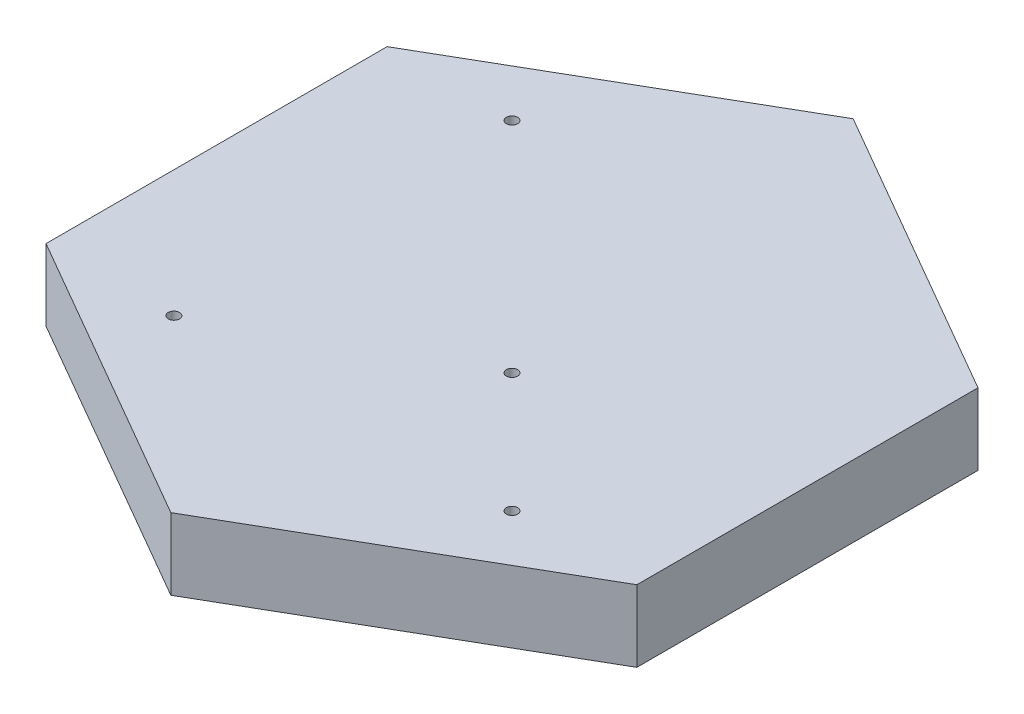
ISO-10303-21;
HEADER;
FILE_DESCRIPTION(('STEP AP214'),'2;1');
FILE_NAME('part.step','',(''),(''),'','','');
FILE_SCHEMA(('AUTOMOTIVE_DESIGN { 1 0 10303 214 1 1 1 1 }'));
ENDSEC;
DATA;
#1=APPLICATION_CONTEXT('core data for automotive mechanical design processes');
#2=APPLICATION_PROTOCOL_DEFINITION('international standard','automotive_design',2000,#1);
#3=PRODUCT_CONTEXT('',#1,'mechanical');
#4=PRODUCT('Part','Part','',(#3));
#5=PRODUCT_RELATED_PRODUCT_CATEGORY('part','',(#4));
#6=PRODUCT_DEFINITION_FORMATION('','',#4);
#7=PRODUCT_DEFINITION_CONTEXT('part definition',#1,'design');
#8=PRODUCT_DEFINITION('design','',#6,#7);
#9=PRODUCT_DEFINITION_SHAPE('','',#8);
#10=(LENGTH_UNIT() NAMED_UNIT(*) SI_UNIT(.MILLI.,.METRE.));
#11=(NAMED_UNIT(*) PLANE_ANGLE_UNIT() SI_UNIT($,.RADIAN.));
#12=(NAMED_UNIT(*) SI_UNIT($,.STERADIAN.) SOLID_ANGLE_UNIT());
#13=UNCERTAINTY_MEASURE_WITH_UNIT(LENGTH_MEASURE(1.E-05),#10,'distance_accuracy_value','');
#14=(GEOMETRIC_REPRESENTATION_CONTEXT(3) GLOBAL_UNCERTAINTY_ASSIGNED_CONTEXT((#13)) GLOBAL_UNIT_ASSIGNED_CONTEXT((#10,
#11,#12)) REPRESENTATION_CONTEXT('',''));
#15=CARTESIAN_POINT('',(0.,0.,0.));
#16=DIRECTION('',(0.,0.,1.));
#17=DIRECTION('',(1.,0.,0.));
#18=AXIS2_PLACEMENT_3D('',#15,#16,#17);
#19=CARTESIAN_POINT('',(8.78679656440357,172.865318601196,8.78679656440358));
#20=DIRECTION('',(0.,-1.,0.));
#21=DIRECTION('',(0.,0.,-1.));
#22=AXIS2_PLACEMENT_3D('',#19,#20,#21);
#23=CYLINDRICAL_SURFACE('',#22,1.);
#24=CARTESIAN_POINT('',(8.78679656440357,0.,8.78679656440358));
#25=DIRECTION('',(0.,1.,0.));
#26=DIRECTION('',(0.,0.,1.));
#27=AXIS2_PLACEMENT_3D('',#24,#25,#26);
#28=CIRCLE('',#27,1.);
#29=CARTESIAN_POINT('',(8.78679656440357,0.,9.78679656440358));
#30=VERTEX_POINT('',#29);
#31=EDGE_CURVE('E125',#30,#30,#28,.T.);
#32=ORIENTED_EDGE('',*,*,#31,.F.);
#33=EDGE_LOOP('',(#32));
#34=FACE_BOUND('',#33,.T.);
#35=CARTESIAN_POINT('',(8.78679656440357,12.7,8.78679656440358));
#36=DIRECTION('',(0.,1.,0.));
#37=DIRECTION('',(0.,0.,1.));
#38=AXIS2_PLACEMENT_3D('',#35,#36,#37);
#39=CIRCLE('',#38,1.);
#40=CARTESIAN_POINT('',(8.78679656440357,12.7,9.78679656440358));
#41=VERTEX_POINT('',#40);
#42=EDGE_CURVE('E111',#41,#41,#39,.T.);
#43=ORIENTED_EDGE('',*,*,#42,.T.);
#44=EDGE_LOOP('',(#43));
#45=FACE_BOUND('',#44,.T.);
#46=ADVANCED_FACE('F33',(#34,#45),#23,.F.);
#47=CARTESIAN_POINT('',(0.,172.865318601196,60.5368002394561));
#48=DIRECTION('',(-0.5,0.,-0.866025403784438));
#49=DIRECTION('',(-0.866025403784439,0.,0.5));
#50=AXIS2_PLACEMENT_3D('',#47,#48,#49);
#51=PLANE('',#50);
#52=DIRECTION('',(0.866025403784439,0.,-0.5));
#53=VECTOR('',#52,1.);
#54=CARTESIAN_POINT('',(0.,12.7,60.5368002394561));
#55=LINE('',#54,#53);
#56=CARTESIAN_POINT('',(0.,12.7,60.5368002394561));
#57=VERTEX_POINT('',#56);
#58=CARTESIAN_POINT('',(52.4264068711929,12.7,30.2684001197281));
#59=VERTEX_POINT('',#58);
#60=EDGE_CURVE('E90',#57,#59,#55,.T.);
#61=ORIENTED_EDGE('',*,*,#60,.F.);
#62=DIRECTION('',(0.,-1.,0.));
#63=VECTOR('',#62,1.);
#64=CARTESIAN_POINT('',(0.,172.865318601196,60.5368002394561));
#65=LINE('',#64,#63);
#66=CARTESIAN_POINT('',(0.,0.,60.5368002394561));
#67=VERTEX_POINT('',#66);
#68=EDGE_CURVE('E49',#57,#67,#65,.T.);
#69=ORIENTED_EDGE('',*,*,#68,.T.);
#70=DIRECTION('',(0.866025403784438,0.,-0.5));
#71=VECTOR('',#70,1.);
#72=CARTESIAN_POINT('',(0.,0.,60.5368002394561));
#73=LINE('',#72,#71);
#74=CARTESIAN_POINT('',(52.4264068711929,0.,30.2684001197281));
#75=VERTEX_POINT('',#74);
#76=EDGE_CURVE('E93',#67,#75,#73,.T.);
#77=ORIENTED_EDGE('',*,*,#76,.T.);
#78=DIRECTION('',(0.,-1.,0.));
#79=VECTOR('',#78,1.);
#80=CARTESIAN_POINT('',(52.4264068711929,172.865318601196,30.2684001197281));
#81=LINE('',#80,#79);
#82=EDGE_CURVE('E86',#59,#75,#81,.T.);
#83=ORIENTED_EDGE('',*,*,#82,.F.);
#84=EDGE_LOOP('',(#61,#69,#77,#83));
#85=FACE_BOUND('',#84,.T.);
#86=ADVANCED_FACE('F88',(#85),#51,.F.);
#87=CARTESIAN_POINT('',(-52.4264068711928,172.865318601196,30.2684001197281));
#88=DIRECTION('',(0.5,0.,-0.866025403784439));
#89=DIRECTION('',(-0.866025403784439,0.,-0.5));
#90=AXIS2_PLACEMENT_3D('',#87,#88,#89);
#91=PLANE('',#90);
#92=DIRECTION('',(0.866025403784439,0.,0.5));
#93=VECTOR('',#92,1.);
#94=CARTESIAN_POINT('',(-52.4264068711928,12.7,30.2684001197281));
#95=LINE('',#94,#93);
#96=CARTESIAN_POINT('',(-52.4264068711928,12.7,30.2684001197281));
#97=VERTEX_POINT('',#96);
#98=EDGE_CURVE('E105',#97,#57,#95,.T.);
#99=ORIENTED_EDGE('',*,*,#98,.F.);
#100=DIRECTION('',(0.,-1.,0.));
#101=VECTOR('',#100,1.);
#102=CARTESIAN_POINT('',(-52.4264068711928,172.865318601196,30.2684001197281));
#103=LINE('',#102,#101);
#104=CARTESIAN_POINT('',(-52.4264068711928,0.,30.2684001197281));
#105=VERTEX_POINT('',#104);
#106=EDGE_CURVE('E146',#97,#105,#103,.T.);
#107=ORIENTED_EDGE('',*,*,#106,.T.);
#108=DIRECTION('',(0.866025403784439,0.,0.5));
#109=VECTOR('',#108,1.);
#110=CARTESIAN_POINT('',(-52.4264068711928,0.,30.2684001197281));
#111=LINE('',#110,#109);
#112=EDGE_CURVE('E142',#105,#67,#111,.T.);
#113=ORIENTED_EDGE('',*,*,#112,.T.);
#114=ORIENTED_EDGE('',*,*,#68,.F.);
#115=EDGE_LOOP('',(#99,#107,#113,#114));
#116=FACE_BOUND('',#115,.T.);
#117=ADVANCED_FACE('F164',(#116),#91,.F.);
#118=CARTESIAN_POINT('',(-52.4264068711928,172.865318601196,-30.2684001197281));
#119=DIRECTION('',(1.,0.,0.));
#120=DIRECTION('',(0.,0.,-1.));
#121=AXIS2_PLACEMENT_3D('',#118,#119,#120);
#122=PLANE('',#121);
#123=DIRECTION('',(0.,0.,1.));
#124=VECTOR('',#123,1.);
#125=CARTESIAN_POINT('',(-52.4264068711928,12.7,-30.2684001197281));
#126=LINE('',#125,#124);
#127=CARTESIAN_POINT('',(-52.4264068711928,12.7,-30.2684001197281));
#128=VERTEX_POINT('',#127);
#129=EDGE_CURVE('E108',#128,#97,#126,.T.);
#130=ORIENTED_EDGE('',*,*,#129,.F.);
#131=DIRECTION('',(0.,-1.,0.));
#132=VECTOR('',#131,1.);
#133=CARTESIAN_POINT('',(-52.4264068711928,172.865318601196,-30.2684001197281));
#134=LINE('',#133,#132);
#135=CARTESIAN_POINT('',(-52.4264068711928,0.,-30.2684001197281));
#136=VERTEX_POINT('',#135);
#137=EDGE_CURVE('E148',#128,#136,#134,.T.);
#138=ORIENTED_EDGE('',*,*,#137,.T.);
#139=DIRECTION('',(0.,0.,1.));
#140=VECTOR('',#139,1.);
#141=CARTESIAN_POINT('',(-52.4264068711928,0.,-30.2684001197281));
#142=LINE('',#141,#140);
#143=EDGE_CURVE('E139',#136,#105,#142,.T.);
#144=ORIENTED_EDGE('',*,*,#143,.T.);
#145=ORIENTED_EDGE('',*,*,#106,.F.);
#146=EDGE_LOOP('',(#130,#138,#144,#145));
#147=FACE_BOUND('',#146,.T.);
#148=ADVANCED_FACE('F163',(#147),#122,.F.);
#149=CARTESIAN_POINT('',(0.,172.865318601196,-60.5368002394561));
#150=DIRECTION('',(0.5,0.,0.866025403784439));
#151=DIRECTION('',(0.866025403784439,0.,-0.5));
#152=AXIS2_PLACEMENT_3D('',#149,#150,#151);
#153=PLANE('',#152);
#154=DIRECTION('',(-0.866025403784439,0.,0.5));
#155=VECTOR('',#154,1.);
#156=CARTESIAN_POINT('',(0.,12.7,-60.5368002394561));
#157=LINE('',#156,#155);
#158=CARTESIAN_POINT('',(0.,12.7,-60.5368002394561));
#159=VERTEX_POINT('',#158);
#160=EDGE_CURVE('E116',#159,#128,#157,.T.);
#161=ORIENTED_EDGE('',*,*,#160,.F.);
#162=DIRECTION('',(0.,-1.,0.));
#163=VECTOR('',#162,1.);
#164=CARTESIAN_POINT('',(0.,172.865318601196,-60.5368002394561));
#165=LINE('',#164,#163);
#166=CARTESIAN_POINT('',(0.,0.,-60.5368002394561));
#167=VERTEX_POINT('',#166);
#168=EDGE_CURVE('E42',#159,#167,#165,.T.);
#169=ORIENTED_EDGE('',*,*,#168,.T.);
#170=DIRECTION('',(-0.866025403784439,0.,0.5));
#171=VECTOR('',#170,1.);
#172=CARTESIAN_POINT('',(0.,0.,-60.5368002394561));
#173=LINE('',#172,#171);
#174=EDGE_CURVE('E136',#167,#136,#173,.T.);
#175=ORIENTED_EDGE('',*,*,#174,.T.);
#176=ORIENTED_EDGE('',*,*,#137,.F.);
#177=EDGE_LOOP('',(#161,#169,#175,#176));
#178=FACE_BOUND('',#177,.T.);
#179=ADVANCED_FACE('F151',(#178),#153,.F.);
#180=CARTESIAN_POINT('',(52.4264068711929,172.865318601196,-30.2684001197281));
#181=DIRECTION('',(-0.5,0.,0.866025403784439));
#182=DIRECTION('',(0.866025403784439,0.,0.5));
#183=AXIS2_PLACEMENT_3D('',#180,#181,#182);
#184=PLANE('',#183);
#185=DIRECTION('',(-0.866025403784439,0.,-0.5));
#186=VECTOR('',#185,1.);
#187=CARTESIAN_POINT('',(52.4264068711929,12.7,-30.2684001197281));
#188=LINE('',#187,#186);
#189=CARTESIAN_POINT('',(52.4264068711929,12.7,-30.2684001197281));
#190=VERTEX_POINT('',#189);
#191=EDGE_CURVE('E56',#190,#159,#188,.T.);
#192=ORIENTED_EDGE('',*,*,#191,.F.);
#193=DIRECTION('',(0.,-1.,0.));
#194=VECTOR('',#193,1.);
#195=CARTESIAN_POINT('',(52.4264068711929,172.865318601196,-30.2684001197281));
#196=LINE('',#195,#194);
#197=CARTESIAN_POINT('',(52.4264068711929,0.,-30.2684001197281));
#198=VERTEX_POINT('',#197);
#199=EDGE_CURVE('E11',#190,#198,#196,.T.);
#200=ORIENTED_EDGE('',*,*,#199,.T.);
#201=DIRECTION('',(-0.866025403784439,0.,-0.5));
#202=VECTOR('',#201,1.);
#203=CARTESIAN_POINT('',(52.4264068711929,0.,-30.2684001197281));
#204=LINE('',#203,#202);
#205=EDGE_CURVE('E133',#198,#167,#204,.T.);
#206=ORIENTED_EDGE('',*,*,#205,.T.);
#207=ORIENTED_EDGE('',*,*,#168,.F.);
#208=EDGE_LOOP('',(#192,#200,#206,#207));
#209=FACE_BOUND('',#208,.T.);
#210=ADVANCED_FACE('F156',(#209),#184,.F.);
#211=CARTESIAN_POINT('',(52.4264068711929,172.865318601196,30.2684001197281));
#212=DIRECTION('',(-1.,0.,0.));
#213=DIRECTION('',(0.,0.,1.));
#214=AXIS2_PLACEMENT_3D('',#211,#212,#213);
#215=PLANE('',#214);
#216=DIRECTION('',(0.,0.,-1.));
#217=VECTOR('',#216,1.);
#218=CARTESIAN_POINT('',(52.4264068711929,12.7,30.2684001197281));
#219=LINE('',#218,#217);
#220=EDGE_CURVE('E99',#59,#190,#219,.T.);
#221=ORIENTED_EDGE('',*,*,#220,.F.);
#222=ORIENTED_EDGE('',*,*,#82,.T.);
#223=DIRECTION('',(0.,0.,-1.));
#224=VECTOR('',#223,1.);
#225=CARTESIAN_POINT('',(52.4264068711929,0.,30.2684001197281));
#226=LINE('',#225,#224);
#227=EDGE_CURVE('E131',#75,#198,#226,.T.);
#228=ORIENTED_EDGE('',*,*,#227,.T.);
#229=ORIENTED_EDGE('',*,*,#199,.F.);
#230=EDGE_LOOP('',(#221,#222,#228,#229));
#231=FACE_BOUND('',#230,.T.);
#232=ADVANCED_FACE('F35',(#231),#215,.F.);
#233=CARTESIAN_POINT('',(-30.,172.865318601196,-30.));
#234=DIRECTION('',(0.,-1.,0.));
#235=DIRECTION('',(0.,0.,-1.));
#236=AXIS2_PLACEMENT_3D('',#233,#234,#235);
#237=CYLINDRICAL_SURFACE('',#236,0.999999999999998);
#238=CARTESIAN_POINT('',(-30.,0.,-30.));
#239=DIRECTION('',(0.,1.,0.));
#240=DIRECTION('',(0.,0.,1.));
#241=AXIS2_PLACEMENT_3D('',#238,#239,#240);
#242=CIRCLE('',#241,0.999999999999998);
#243=CARTESIAN_POINT('',(-30.,0.,-29.));
#244=VERTEX_POINT('',#243);
#245=EDGE_CURVE('E128',#244,#244,#242,.T.);
#246=ORIENTED_EDGE('',*,*,#245,.F.);
#247=EDGE_LOOP('',(#246));
#248=FACE_BOUND('',#247,.T.);
#249=CARTESIAN_POINT('',(-30.,12.7,-30.));
#250=DIRECTION('',(0.,1.,0.));
#251=DIRECTION('',(0.,0.,1.));
#252=AXIS2_PLACEMENT_3D('',#249,#250,#251);
#253=CIRCLE('',#252,0.999999999999998);
#254=CARTESIAN_POINT('',(-30.,12.7,-29.));
#255=VERTEX_POINT('',#254);
#256=EDGE_CURVE('E106',#255,#255,#253,.T.);
#257=ORIENTED_EDGE('',*,*,#256,.T.);
#258=EDGE_LOOP('',(#257));
#259=FACE_BOUND('',#258,.T.);
#260=ADVANCED_FACE('F184',(#248,#259),#237,.F.);
#261=CARTESIAN_POINT('',(30.,172.865318601196,30.));
#262=DIRECTION('',(0.,-1.,0.));
#263=DIRECTION('',(0.,0.,-1.));
#264=AXIS2_PLACEMENT_3D('',#261,#262,#263);
#265=CYLINDRICAL_SURFACE('',#264,0.999999999999998);
#266=CARTESIAN_POINT('',(30.,0.,30.));
#267=DIRECTION('',(0.,1.,0.));
#268=DIRECTION('',(0.,0.,1.));
#269=AXIS2_PLACEMENT_3D('',#266,#267,#268);
#270=CIRCLE('',#269,0.999999999999998);
#271=CARTESIAN_POINT('',(30.,0.,31.));
#272=VERTEX_POINT('',#271);
#273=EDGE_CURVE('E122',#272,#272,#270,.T.);
#274=ORIENTED_EDGE('',*,*,#273,.F.);
#275=EDGE_LOOP('',(#274));
#276=FACE_BOUND('',#275,.T.);
#277=CARTESIAN_POINT('',(30.,12.7,30.));
#278=DIRECTION('',(0.,1.,0.));
#279=DIRECTION('',(0.,0.,1.));
#280=AXIS2_PLACEMENT_3D('',#277,#278,#279);
#281=CIRCLE('',#280,0.999999999999998);
#282=CARTESIAN_POINT('',(30.,12.7,31.));
#283=VERTEX_POINT('',#282);
#284=EDGE_CURVE('E214',#283,#283,#281,.T.);
#285=ORIENTED_EDGE('',*,*,#284,.T.);
#286=EDGE_LOOP('',(#285));
#287=FACE_BOUND('',#286,.T.);
#288=ADVANCED_FACE('F182',(#276,#287),#265,.F.);
#289=CARTESIAN_POINT('',(0.,0.,0.));
#290=DIRECTION('',(0.,1.,0.));
#291=DIRECTION('',(0.,0.,1.));
#292=AXIS2_PLACEMENT_3D('',#289,#290,#291);
#293=PLANE('',#292);
#294=ORIENTED_EDGE('',*,*,#273,.T.);
#295=EDGE_LOOP('',(#294));
#296=FACE_BOUND('',#295,.T.);
#297=ORIENTED_EDGE('',*,*,#245,.T.);
#298=EDGE_LOOP('',(#297));
#299=FACE_BOUND('',#298,.T.);
#300=ORIENTED_EDGE('',*,*,#227,.F.);
#301=ORIENTED_EDGE('',*,*,#76,.F.);
#302=ORIENTED_EDGE('',*,*,#112,.F.);
#303=ORIENTED_EDGE('',*,*,#143,.F.);
#304=ORIENTED_EDGE('',*,*,#174,.F.);
#305=ORIENTED_EDGE('',*,*,#205,.F.);
#306=EDGE_LOOP('',(#300,#301,#302,#303,#304,#305));
#307=FACE_BOUND('',#306,.T.);
#308=ORIENTED_EDGE('',*,*,#31,.T.);
#309=EDGE_LOOP('',(#308));
#310=FACE_BOUND('',#309,.T.);
#311=CARTESIAN_POINT('',(-30.,0.,30.));
#312=DIRECTION('',(0.,1.,0.));
#313=DIRECTION('',(0.,0.,1.));
#314=AXIS2_PLACEMENT_3D('',#311,#312,#313);
#315=CIRCLE('',#314,0.999999999999998);
#316=CARTESIAN_POINT('',(-30.,0.,31.));
#317=VERTEX_POINT('',#316);
#318=EDGE_CURVE('E101',#317,#317,#315,.T.);
#319=ORIENTED_EDGE('',*,*,#318,.T.);
#320=EDGE_LOOP('',(#319));
#321=FACE_BOUND('',#320,.T.);
#322=ADVANCED_FACE('F158',(#296,#299,#307,#310,#321),#293,.F.);
#323=CARTESIAN_POINT('',(-30.,172.865318601196,30.));
#324=DIRECTION('',(0.,-1.,0.));
#325=DIRECTION('',(0.,0.,-1.));
#326=AXIS2_PLACEMENT_3D('',#323,#324,#325);
#327=CYLINDRICAL_SURFACE('',#326,0.999999999999998);
#328=ORIENTED_EDGE('',*,*,#318,.F.);
#329=EDGE_LOOP('',(#328));
#330=FACE_BOUND('',#329,.T.);
#331=CARTESIAN_POINT('',(-30.,12.7,30.));
#332=DIRECTION('',(0.,1.,0.));
#333=DIRECTION('',(0.,0.,1.));
#334=AXIS2_PLACEMENT_3D('',#331,#332,#333);
#335=CIRCLE('',#334,0.999999999999998);
#336=CARTESIAN_POINT('',(-30.,12.7,31.));
#337=VERTEX_POINT('',#336);
#338=EDGE_CURVE('E37',#337,#337,#335,.T.);
#339=ORIENTED_EDGE('',*,*,#338,.T.);
#340=EDGE_LOOP('',(#339));
#341=FACE_BOUND('',#340,.T.);
#342=ADVANCED_FACE('F189',(#330,#341),#327,.F.);
#343=CARTESIAN_POINT('',(0.,12.7,0.));
#344=DIRECTION('',(0.,1.,0.));
#345=DIRECTION('',(0.,0.,1.));
#346=AXIS2_PLACEMENT_3D('',#343,#344,#345);
#347=PLANE('',#346);
#348=ORIENTED_EDGE('',*,*,#338,.F.);
#349=EDGE_LOOP('',(#348));
#350=FACE_BOUND('',#349,.T.);
#351=ORIENTED_EDGE('',*,*,#284,.F.);
#352=EDGE_LOOP('',(#351));
#353=FACE_BOUND('',#352,.T.);
#354=ORIENTED_EDGE('',*,*,#42,.F.);
#355=EDGE_LOOP('',(#354));
#356=FACE_BOUND('',#355,.T.);
#357=ORIENTED_EDGE('',*,*,#256,.F.);
#358=EDGE_LOOP('',(#357));
#359=FACE_BOUND('',#358,.T.);
#360=ORIENTED_EDGE('',*,*,#60,.T.);
#361=ORIENTED_EDGE('',*,*,#220,.T.);
#362=ORIENTED_EDGE('',*,*,#191,.T.);
#363=ORIENTED_EDGE('',*,*,#160,.T.);
#364=ORIENTED_EDGE('',*,*,#129,.T.);
#365=ORIENTED_EDGE('',*,*,#98,.T.);
#366=EDGE_LOOP('',(#360,#361,#362,#363,#364,#365));
#367=FACE_BOUND('',#366,.T.);
#368=ADVANCED_FACE('F103',(#350,#353,#356,#359,#367),#347,.T.);
#369=CLOSED_SHELL('',(#46,#86,#117,#148,#179,#210,#232,#260,#288,#322,#342,#368));
#370=MANIFOLD_SOLID_BREP('B2',#369);
#371=ADVANCED_BREP_SHAPE_REPRESENTATION('',(#18,#370),#14);
#372=SHAPE_DEFINITION_REPRESENTATION(#9,#371);
ENDSEC;
END-ISO-10303-21;
